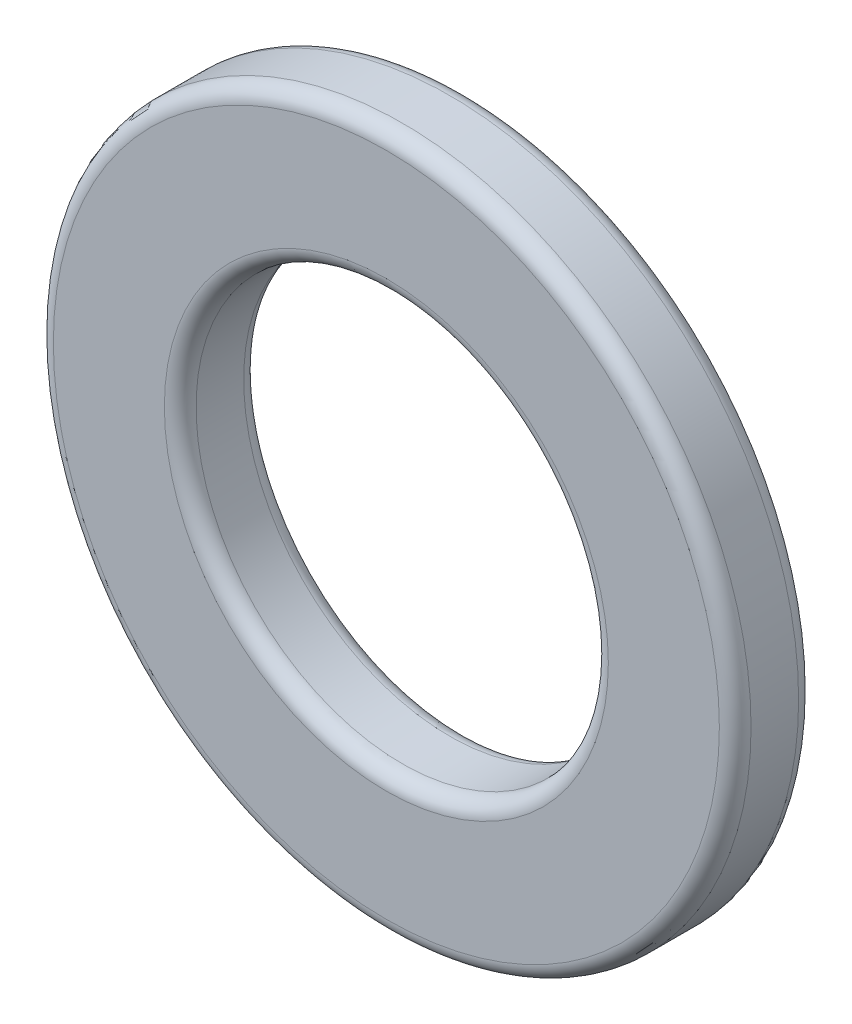
ISO-10303-21;
HEADER;
FILE_DESCRIPTION(('STEP AP214'),'2;1');
FILE_NAME('part.step','',(''),(''),'','','');
FILE_SCHEMA(('AUTOMOTIVE_DESIGN { 1 0 10303 214 1 1 1 1 }'));
ENDSEC;
DATA;
#1=APPLICATION_CONTEXT('core data for automotive mechanical design processes');
#2=APPLICATION_PROTOCOL_DEFINITION('international standard','automotive_design',2000,#1);
#3=PRODUCT_CONTEXT('',#1,'mechanical');
#4=PRODUCT('Part','Part','',(#3));
#5=PRODUCT_RELATED_PRODUCT_CATEGORY('part','',(#4));
#6=PRODUCT_DEFINITION_FORMATION('','',#4);
#7=PRODUCT_DEFINITION_CONTEXT('part definition',#1,'design');
#8=PRODUCT_DEFINITION('design','',#6,#7);
#9=PRODUCT_DEFINITION_SHAPE('','',#8);
#10=(LENGTH_UNIT() NAMED_UNIT(*) SI_UNIT(.MILLI.,.METRE.));
#11=(NAMED_UNIT(*) PLANE_ANGLE_UNIT() SI_UNIT($,.RADIAN.));
#12=(NAMED_UNIT(*) SI_UNIT($,.STERADIAN.) SOLID_ANGLE_UNIT());
#13=UNCERTAINTY_MEASURE_WITH_UNIT(LENGTH_MEASURE(1.E-05),#10,'distance_accuracy_value','');
#14=(GEOMETRIC_REPRESENTATION_CONTEXT(3) GLOBAL_UNCERTAINTY_ASSIGNED_CONTEXT((#13)) GLOBAL_UNIT_ASSIGNED_CONTEXT((#10,
#11,#12)) REPRESENTATION_CONTEXT('',''));
#15=CARTESIAN_POINT('',(0.,0.,0.));
#16=DIRECTION('',(0.,0.,1.));
#17=DIRECTION('',(1.,0.,0.));
#18=AXIS2_PLACEMENT_3D('',#15,#16,#17);
#19=CARTESIAN_POINT('',(0.,0.,2.5));
#20=DIRECTION('',(0.,0.,1.));
#21=DIRECTION('',(1.,0.,0.));
#22=AXIS2_PLACEMENT_3D('',#19,#20,#21);
#23=PLANE('',#22);
#24=CARTESIAN_POINT('',(0.,0.,2.5));
#25=DIRECTION('',(0.,0.,1.));
#26=DIRECTION('',(1.,0.,0.));
#27=AXIS2_PLACEMENT_3D('',#24,#25,#26);
#28=CIRCLE('',#27,10.5);
#29=CARTESIAN_POINT('',(10.5,0.,2.5));
#30=VERTEX_POINT('',#29);
#31=EDGE_CURVE('E10',#30,#30,#28,.T.);
#32=ORIENTED_EDGE('',*,*,#31,.T.);
#33=EDGE_LOOP('',(#32));
#34=FACE_BOUND('',#33,.T.);
#35=CARTESIAN_POINT('',(0.,0.,2.5));
#36=DIRECTION('',(0.,0.,1.));
#37=DIRECTION('',(1.,0.,0.));
#38=AXIS2_PLACEMENT_3D('',#35,#36,#37);
#39=CIRCLE('',#38,7.);
#40=CARTESIAN_POINT('',(7.,0.,2.5));
#41=VERTEX_POINT('',#40);
#42=EDGE_CURVE('E37',#41,#41,#39,.F.);
#43=ORIENTED_EDGE('',*,*,#42,.T.);
#44=EDGE_LOOP('',(#43));
#45=FACE_BOUND('',#44,.T.);
#46=ADVANCED_FACE('F30',(#34,#45),#23,.T.);
#47=CARTESIAN_POINT('',(0.,0.,0.));
#48=DIRECTION('',(0.,0.,1.));
#49=DIRECTION('',(1.,0.,0.));
#50=AXIS2_PLACEMENT_3D('',#47,#48,#49);
#51=PLANE('',#50);
#52=CARTESIAN_POINT('',(0.,0.,0.));
#53=DIRECTION('',(0.,0.,1.));
#54=DIRECTION('',(1.,0.,0.));
#55=AXIS2_PLACEMENT_3D('',#52,#53,#54);
#56=CIRCLE('',#55,7.);
#57=CARTESIAN_POINT('',(7.,0.,0.));
#58=VERTEX_POINT('',#57);
#59=EDGE_CURVE('E56',#58,#58,#56,.T.);
#60=ORIENTED_EDGE('',*,*,#59,.T.);
#61=EDGE_LOOP('',(#60));
#62=FACE_BOUND('',#61,.T.);
#63=CARTESIAN_POINT('',(0.,0.,0.));
#64=DIRECTION('',(0.,0.,1.));
#65=DIRECTION('',(1.,0.,0.));
#66=AXIS2_PLACEMENT_3D('',#63,#64,#65);
#67=CIRCLE('',#66,10.5);
#68=CARTESIAN_POINT('',(10.5,0.,0.));
#69=VERTEX_POINT('',#68);
#70=EDGE_CURVE('E59',#69,#69,#67,.F.);
#71=ORIENTED_EDGE('',*,*,#70,.T.);
#72=EDGE_LOOP('',(#71));
#73=FACE_BOUND('',#72,.T.);
#74=ADVANCED_FACE('F63',(#62,#73),#51,.F.);
#75=CARTESIAN_POINT('',(0.,0.,2.5));
#76=DIRECTION('',(0.,0.,-1.));
#77=DIRECTION('',(-1.,0.,0.));
#78=AXIS2_PLACEMENT_3D('',#75,#76,#77);
#79=CYLINDRICAL_SURFACE('',#78,11.);
#80=CARTESIAN_POINT('',(0.,0.,0.5));
#81=DIRECTION('',(0.,0.,1.));
#82=DIRECTION('',(1.,0.,0.));
#83=AXIS2_PLACEMENT_3D('',#80,#81,#82);
#84=CIRCLE('',#83,11.);
#85=CARTESIAN_POINT('',(11.,0.,0.5));
#86=VERTEX_POINT('',#85);
#87=EDGE_CURVE('E41',#86,#86,#84,.T.);
#88=ORIENTED_EDGE('',*,*,#87,.T.);
#89=EDGE_LOOP('',(#88));
#90=FACE_BOUND('',#89,.T.);
#91=CARTESIAN_POINT('',(0.,0.,2.));
#92=DIRECTION('',(0.,0.,1.));
#93=DIRECTION('',(1.,0.,0.));
#94=AXIS2_PLACEMENT_3D('',#91,#92,#93);
#95=CIRCLE('',#94,11.);
#96=CARTESIAN_POINT('',(11.,0.,2.));
#97=VERTEX_POINT('',#96);
#98=EDGE_CURVE('E45',#97,#97,#95,.F.);
#99=ORIENTED_EDGE('',*,*,#98,.T.);
#100=EDGE_LOOP('',(#99));
#101=FACE_BOUND('',#100,.T.);
#102=ADVANCED_FACE('F73',(#90,#101),#79,.T.);
#103=CARTESIAN_POINT('',(0.,0.,2.5));
#104=DIRECTION('',(0.,0.,-1.));
#105=DIRECTION('',(-1.,0.,0.));
#106=AXIS2_PLACEMENT_3D('',#103,#104,#105);
#107=CYLINDRICAL_SURFACE('',#106,6.5);
#108=CARTESIAN_POINT('',(0.,0.,0.5));
#109=DIRECTION('',(0.,0.,1.));
#110=DIRECTION('',(1.,0.,0.));
#111=AXIS2_PLACEMENT_3D('',#108,#109,#110);
#112=CIRCLE('',#111,6.5);
#113=CARTESIAN_POINT('',(6.5,0.,0.5));
#114=VERTEX_POINT('',#113);
#115=EDGE_CURVE('E50',#114,#114,#112,.F.);
#116=ORIENTED_EDGE('',*,*,#115,.T.);
#117=EDGE_LOOP('',(#116));
#118=FACE_BOUND('',#117,.T.);
#119=CARTESIAN_POINT('',(0.,0.,2.));
#120=DIRECTION('',(0.,0.,1.));
#121=DIRECTION('',(1.,0.,0.));
#122=AXIS2_PLACEMENT_3D('',#119,#120,#121);
#123=CIRCLE('',#122,6.5);
#124=CARTESIAN_POINT('',(6.5,0.,2.));
#125=VERTEX_POINT('',#124);
#126=EDGE_CURVE('E53',#125,#125,#123,.T.);
#127=ORIENTED_EDGE('',*,*,#126,.T.);
#128=EDGE_LOOP('',(#127));
#129=FACE_BOUND('',#128,.T.);
#130=ADVANCED_FACE('F76',(#118,#129),#107,.F.);
#131=CARTESIAN_POINT('',(0.,0.,0.5));
#132=DIRECTION('',(0.,0.,1.));
#133=DIRECTION('',(1.,0.,0.));
#134=AXIS2_PLACEMENT_3D('',#131,#132,#133);
#135=TOROIDAL_SURFACE('',#134,7.,0.5);
#136=ORIENTED_EDGE('',*,*,#115,.F.);
#137=EDGE_LOOP('',(#136));
#138=FACE_BOUND('',#137,.T.);
#139=ORIENTED_EDGE('',*,*,#59,.F.);
#140=EDGE_LOOP('',(#139));
#141=FACE_BOUND('',#140,.T.);
#142=ADVANCED_FACE('F69',(#138,#141),#135,.T.);
#143=CARTESIAN_POINT('',(0.,0.,0.5));
#144=DIRECTION('',(0.,0.,1.));
#145=DIRECTION('',(1.,0.,0.));
#146=AXIS2_PLACEMENT_3D('',#143,#144,#145);
#147=TOROIDAL_SURFACE('',#146,10.5,0.5);
#148=ORIENTED_EDGE('',*,*,#70,.F.);
#149=EDGE_LOOP('',(#148));
#150=FACE_BOUND('',#149,.T.);
#151=ORIENTED_EDGE('',*,*,#87,.F.);
#152=EDGE_LOOP('',(#151));
#153=FACE_BOUND('',#152,.T.);
#154=ADVANCED_FACE('F65',(#150,#153),#147,.T.);
#155=CARTESIAN_POINT('',(0.,0.,2.));
#156=DIRECTION('',(0.,0.,1.));
#157=DIRECTION('',(1.,0.,0.));
#158=AXIS2_PLACEMENT_3D('',#155,#156,#157);
#159=TOROIDAL_SURFACE('',#158,10.5,0.5);
#160=ORIENTED_EDGE('',*,*,#98,.F.);
#161=EDGE_LOOP('',(#160));
#162=FACE_BOUND('',#161,.T.);
#163=ORIENTED_EDGE('',*,*,#31,.F.);
#164=EDGE_LOOP('',(#163));
#165=FACE_BOUND('',#164,.T.);
#166=ADVANCED_FACE('F68',(#162,#165),#159,.T.);
#167=CARTESIAN_POINT('',(0.,0.,2.));
#168=DIRECTION('',(0.,0.,1.));
#169=DIRECTION('',(1.,0.,0.));
#170=AXIS2_PLACEMENT_3D('',#167,#168,#169);
#171=TOROIDAL_SURFACE('',#170,7.,0.5);
#172=ORIENTED_EDGE('',*,*,#42,.F.);
#173=EDGE_LOOP('',(#172));
#174=FACE_BOUND('',#173,.T.);
#175=ORIENTED_EDGE('',*,*,#126,.F.);
#176=EDGE_LOOP('',(#175));
#177=FACE_BOUND('',#176,.T.);
#178=ADVANCED_FACE('F32',(#174,#177),#171,.T.);
#179=CLOSED_SHELL('',(#46,#74,#102,#130,#142,#154,#166,#178));
#180=MANIFOLD_SOLID_BREP('B2',#179);
#181=ADVANCED_BREP_SHAPE_REPRESENTATION('',(#18,#180),#14);
#182=SHAPE_DEFINITION_REPRESENTATION(#9,#181);
ENDSEC;
END-ISO-10303-21;
